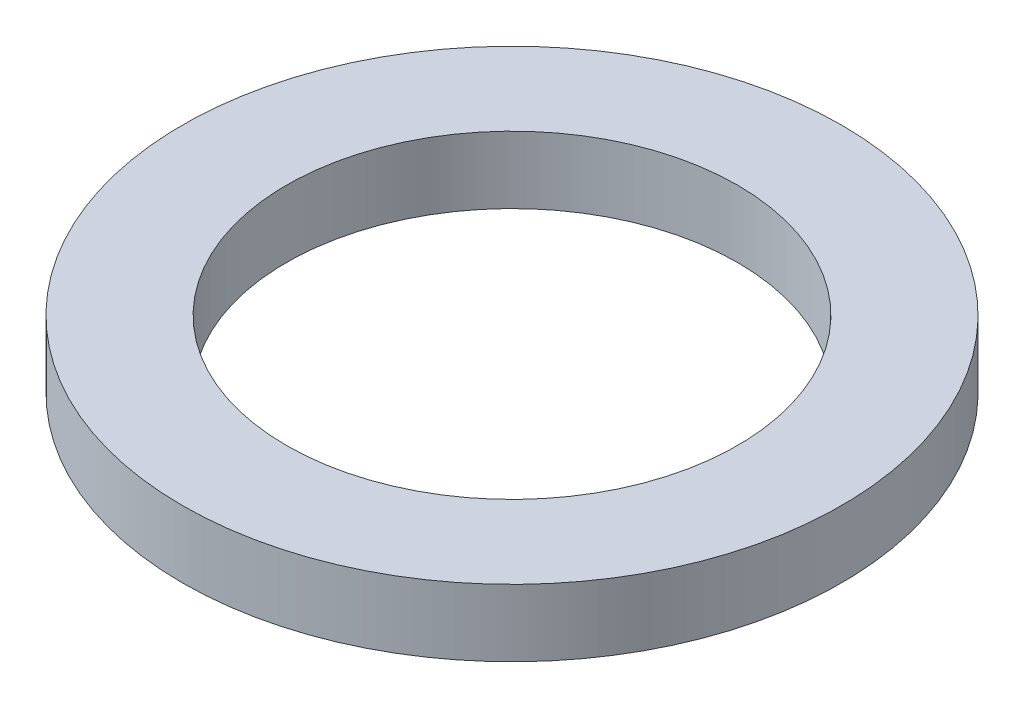
ISO-10303-21;
HEADER;
FILE_DESCRIPTION(('STEP AP214'),'2;1');
FILE_NAME('part.step','',(''),(''),'','','');
FILE_SCHEMA(('AUTOMOTIVE_DESIGN { 1 0 10303 214 1 1 1 1 }'));
ENDSEC;
DATA;
#1=APPLICATION_CONTEXT('core data for automotive mechanical design processes');
#2=APPLICATION_PROTOCOL_DEFINITION('international standard','automotive_design',2000,#1);
#3=PRODUCT_CONTEXT('',#1,'mechanical');
#4=PRODUCT('Part','Part','',(#3));
#5=PRODUCT_RELATED_PRODUCT_CATEGORY('part','',(#4));
#6=PRODUCT_DEFINITION_FORMATION('','',#4);
#7=PRODUCT_DEFINITION_CONTEXT('part definition',#1,'design');
#8=PRODUCT_DEFINITION('design','',#6,#7);
#9=PRODUCT_DEFINITION_SHAPE('','',#8);
#10=(LENGTH_UNIT() NAMED_UNIT(*) SI_UNIT(.MILLI.,.METRE.));
#11=(NAMED_UNIT(*) PLANE_ANGLE_UNIT() SI_UNIT($,.RADIAN.));
#12=(NAMED_UNIT(*) SI_UNIT($,.STERADIAN.) SOLID_ANGLE_UNIT());
#13=UNCERTAINTY_MEASURE_WITH_UNIT(LENGTH_MEASURE(1.E-05),#10,'distance_accuracy_value','');
#14=(GEOMETRIC_REPRESENTATION_CONTEXT(3) GLOBAL_UNCERTAINTY_ASSIGNED_CONTEXT((#13)) GLOBAL_UNIT_ASSIGNED_CONTEXT((#10,
#11,#12)) REPRESENTATION_CONTEXT('',''));
#15=CARTESIAN_POINT('',(0.,0.,0.));
#16=DIRECTION('',(0.,0.,1.));
#17=DIRECTION('',(1.,0.,0.));
#18=AXIS2_PLACEMENT_3D('',#15,#16,#17);
#19=CARTESIAN_POINT('',(0.,-0.6096,0.));
#20=DIRECTION('',(0.,1.,0.));
#21=DIRECTION('',(0.,0.,1.));
#22=AXIS2_PLACEMENT_3D('',#19,#20,#21);
#23=PLANE('',#22);
#24=CARTESIAN_POINT('',(0.,-0.6096,0.));
#25=DIRECTION('',(0.,-1.,0.));
#26=DIRECTION('',(0.,0.,-1.));
#27=AXIS2_PLACEMENT_3D('',#24,#25,#26);
#28=CIRCLE('',#27,4.1021);
#29=CARTESIAN_POINT('',(0.,-0.6096,-4.1021));
#30=VERTEX_POINT('',#29);
#31=EDGE_CURVE('E27',#30,#30,#28,.F.);
#32=ORIENTED_EDGE('',*,*,#31,.T.);
#33=EDGE_LOOP('',(#32));
#34=FACE_BOUND('',#33,.T.);
#35=CARTESIAN_POINT('',(0.,-0.6096,0.));
#36=DIRECTION('',(0.,-1.,0.));
#37=DIRECTION('',(0.,0.,-1.));
#38=AXIS2_PLACEMENT_3D('',#35,#36,#37);
#39=CIRCLE('',#38,5.9944);
#40=CARTESIAN_POINT('',(0.,-0.6096,-5.9944));
#41=VERTEX_POINT('',#40);
#42=EDGE_CURVE('E18',#41,#41,#39,.F.);
#43=ORIENTED_EDGE('',*,*,#42,.F.);
#44=EDGE_LOOP('',(#43));
#45=FACE_BOUND('',#44,.T.);
#46=ADVANCED_FACE('F15',(#34,#45),#23,.F.);
#47=CARTESIAN_POINT('',(0.,0.6096,0.));
#48=DIRECTION('',(0.,-1.,0.));
#49=DIRECTION('',(0.,0.,-1.));
#50=AXIS2_PLACEMENT_3D('',#47,#48,#49);
#51=CYLINDRICAL_SURFACE('',#50,5.9944);
#52=ORIENTED_EDGE('',*,*,#42,.T.);
#53=EDGE_LOOP('',(#52));
#54=FACE_BOUND('',#53,.T.);
#55=CARTESIAN_POINT('',(0.,0.6096,0.));
#56=DIRECTION('',(0.,-1.,0.));
#57=DIRECTION('',(0.,0.,-1.));
#58=AXIS2_PLACEMENT_3D('',#55,#56,#57);
#59=CIRCLE('',#58,5.9944);
#60=CARTESIAN_POINT('',(0.,0.6096,-5.9944));
#61=VERTEX_POINT('',#60);
#62=EDGE_CURVE('E22',#61,#61,#59,.F.);
#63=ORIENTED_EDGE('',*,*,#62,.F.);
#64=EDGE_LOOP('',(#63));
#65=FACE_BOUND('',#64,.T.);
#66=ADVANCED_FACE('F35',(#54,#65),#51,.T.);
#67=CARTESIAN_POINT('',(0.,0.6096,0.));
#68=DIRECTION('',(0.,-1.,0.));
#69=DIRECTION('',(0.,0.,-1.));
#70=AXIS2_PLACEMENT_3D('',#67,#68,#69);
#71=CYLINDRICAL_SURFACE('',#70,4.1021);
#72=CARTESIAN_POINT('',(0.,0.6096,0.));
#73=DIRECTION('',(0.,-1.,0.));
#74=DIRECTION('',(0.,0.,-1.));
#75=AXIS2_PLACEMENT_3D('',#72,#73,#74);
#76=CIRCLE('',#75,4.1021);
#77=CARTESIAN_POINT('',(0.,0.6096,-4.1021));
#78=VERTEX_POINT('',#77);
#79=EDGE_CURVE('E10',#78,#78,#76,.T.);
#80=ORIENTED_EDGE('',*,*,#79,.F.);
#81=EDGE_LOOP('',(#80));
#82=FACE_BOUND('',#81,.T.);
#83=ORIENTED_EDGE('',*,*,#31,.F.);
#84=EDGE_LOOP('',(#83));
#85=FACE_BOUND('',#84,.T.);
#86=ADVANCED_FACE('F43',(#82,#85),#71,.F.);
#87=CARTESIAN_POINT('',(0.,0.6096,0.));
#88=DIRECTION('',(0.,1.,0.));
#89=DIRECTION('',(0.,0.,1.));
#90=AXIS2_PLACEMENT_3D('',#87,#88,#89);
#91=PLANE('',#90);
#92=ORIENTED_EDGE('',*,*,#79,.T.);
#93=EDGE_LOOP('',(#92));
#94=FACE_BOUND('',#93,.T.);
#95=ORIENTED_EDGE('',*,*,#62,.T.);
#96=EDGE_LOOP('',(#95));
#97=FACE_BOUND('',#96,.T.);
#98=ADVANCED_FACE('F44',(#94,#97),#91,.T.);
#99=CLOSED_SHELL('',(#46,#66,#86,#98));
#100=MANIFOLD_SOLID_BREP('B1',#99);
#101=ADVANCED_BREP_SHAPE_REPRESENTATION('',(#18,#100),#14);
#102=SHAPE_DEFINITION_REPRESENTATION(#9,#101);
ENDSEC;
END-ISO-10303-21;
